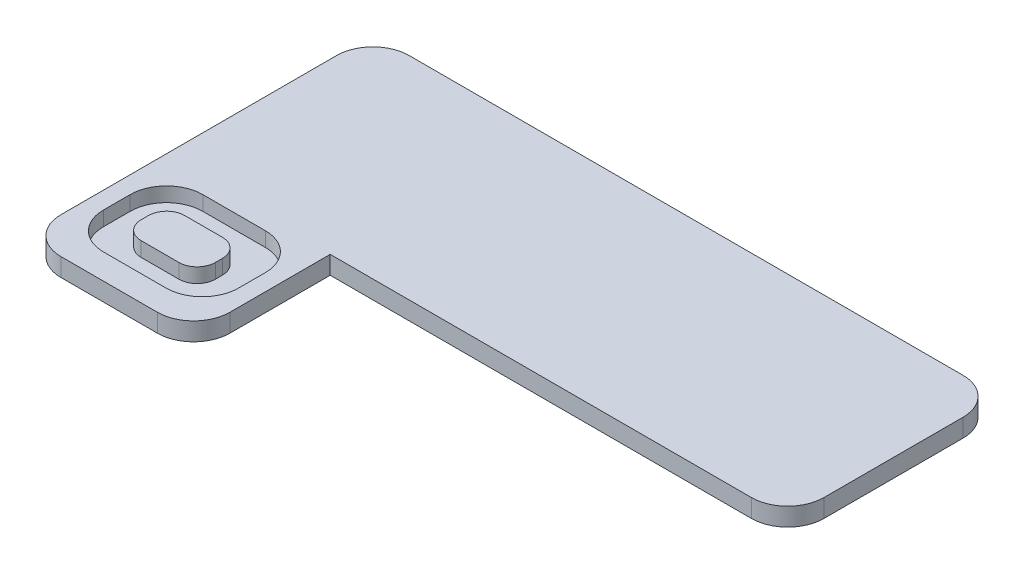
ISO-10303-21;
HEADER;
FILE_DESCRIPTION(('STEP AP214'),'2;1');
FILE_NAME('part.step','',(''),(''),'','','');
FILE_SCHEMA(('AUTOMOTIVE_DESIGN { 1 0 10303 214 1 1 1 1 }'));
ENDSEC;
DATA;
#1=APPLICATION_CONTEXT('core data for automotive mechanical design processes');
#2=APPLICATION_PROTOCOL_DEFINITION('international standard','automotive_design',2000,#1);
#3=PRODUCT_CONTEXT('',#1,'mechanical');
#4=PRODUCT('Part','Part','',(#3));
#5=PRODUCT_RELATED_PRODUCT_CATEGORY('part','',(#4));
#6=PRODUCT_DEFINITION_FORMATION('','',#4);
#7=PRODUCT_DEFINITION_CONTEXT('part definition',#1,'design');
#8=PRODUCT_DEFINITION('design','',#6,#7);
#9=PRODUCT_DEFINITION_SHAPE('','',#8);
#10=(LENGTH_UNIT() NAMED_UNIT(*) SI_UNIT(.MILLI.,.METRE.));
#11=(NAMED_UNIT(*) PLANE_ANGLE_UNIT() SI_UNIT($,.RADIAN.));
#12=(NAMED_UNIT(*) SI_UNIT($,.STERADIAN.) SOLID_ANGLE_UNIT());
#13=UNCERTAINTY_MEASURE_WITH_UNIT(LENGTH_MEASURE(1.E-05),#10,'distance_accuracy_value','');
#14=(GEOMETRIC_REPRESENTATION_CONTEXT(3) GLOBAL_UNCERTAINTY_ASSIGNED_CONTEXT((#13)) GLOBAL_UNIT_ASSIGNED_CONTEXT((#10,
#11,#12)) REPRESENTATION_CONTEXT('',''));
#15=CARTESIAN_POINT('',(0.,0.,0.));
#16=DIRECTION('',(0.,0.,1.));
#17=DIRECTION('',(1.,0.,0.));
#18=AXIS2_PLACEMENT_3D('',#15,#16,#17);
#19=CARTESIAN_POINT('',(2.54,1.27,21.8314835455681));
#20=DIRECTION('',(0.,-1.,0.));
#21=DIRECTION('',(0.,0.,-1.));
#22=AXIS2_PLACEMENT_3D('',#19,#20,#21);
#23=CYLINDRICAL_SURFACE('',#22,2.54);
#24=CARTESIAN_POINT('',(2.54,0.,21.8314835455681));
#25=DIRECTION('',(0.,1.,0.));
#26=DIRECTION('',(0.,0.,1.));
#27=AXIS2_PLACEMENT_3D('',#24,#25,#26);
#28=CIRCLE('',#27,2.54);
#29=CARTESIAN_POINT('',(0.,0.,21.831483545568));
#30=VERTEX_POINT('',#29);
#31=CARTESIAN_POINT('',(2.54000000000002,0.,24.3714835455681));
#32=VERTEX_POINT('',#31);
#33=EDGE_CURVE('E340',#30,#32,#28,.T.);
#34=ORIENTED_EDGE('',*,*,#33,.T.);
#35=DIRECTION('',(0.,-1.,0.));
#36=VECTOR('',#35,1.);
#37=CARTESIAN_POINT('',(2.54000000000002,1.27,24.3714835455681));
#38=LINE('',#37,#36);
#39=CARTESIAN_POINT('',(2.54000000000002,1.27,24.3714835455681));
#40=VERTEX_POINT('',#39);
#41=EDGE_CURVE('E11',#40,#32,#38,.T.);
#42=ORIENTED_EDGE('',*,*,#41,.F.);
#43=CARTESIAN_POINT('',(2.54,1.27,21.8314835455681));
#44=DIRECTION('',(0.,1.,0.));
#45=DIRECTION('',(0.,0.,1.));
#46=AXIS2_PLACEMENT_3D('',#43,#44,#45);
#47=CIRCLE('',#46,2.54);
#48=CARTESIAN_POINT('',(0.,1.27,21.831483545568));
#49=VERTEX_POINT('',#48);
#50=EDGE_CURVE('E354',#49,#40,#47,.T.);
#51=ORIENTED_EDGE('',*,*,#50,.F.);
#52=DIRECTION('',(0.,-1.,0.));
#53=VECTOR('',#52,1.);
#54=CARTESIAN_POINT('',(0.,1.27,21.831483545568));
#55=LINE('',#54,#53);
#56=EDGE_CURVE('E378',#49,#30,#55,.T.);
#57=ORIENTED_EDGE('',*,*,#56,.T.);
#58=EDGE_LOOP('',(#34,#42,#51,#57));
#59=FACE_BOUND('',#58,.T.);
#60=ADVANCED_FACE('F39',(#59),#23,.T.);
#61=CARTESIAN_POINT('',(2.54000000000002,1.27,24.3714835455681));
#62=DIRECTION('',(0.,0.,-1.));
#63=DIRECTION('',(-1.,0.,0.));
#64=AXIS2_PLACEMENT_3D('',#61,#62,#63);
#65=PLANE('',#64);
#66=DIRECTION('',(1.,0.,0.));
#67=VECTOR('',#66,1.);
#68=CARTESIAN_POINT('',(2.54000000000002,0.,24.3714835455681));
#69=LINE('',#68,#67);
#70=CARTESIAN_POINT('',(9.28733760299624,0.,24.3714835455681));
#71=VERTEX_POINT('',#70);
#72=EDGE_CURVE('E381',#32,#71,#69,.T.);
#73=ORIENTED_EDGE('',*,*,#72,.T.);
#74=DIRECTION('',(0.,-1.,0.));
#75=VECTOR('',#74,1.);
#76=CARTESIAN_POINT('',(9.28733760299624,1.27,24.3714835455681));
#77=LINE('',#76,#75);
#78=CARTESIAN_POINT('',(9.28733760299624,1.27,24.3714835455681));
#79=VERTEX_POINT('',#78);
#80=EDGE_CURVE('E46',#79,#71,#77,.T.);
#81=ORIENTED_EDGE('',*,*,#80,.F.);
#82=DIRECTION('',(1.,0.,0.));
#83=VECTOR('',#82,1.);
#84=CARTESIAN_POINT('',(2.54000000000002,1.27,24.3714835455681));
#85=LINE('',#84,#83);
#86=EDGE_CURVE('E357',#40,#79,#85,.T.);
#87=ORIENTED_EDGE('',*,*,#86,.F.);
#88=ORIENTED_EDGE('',*,*,#41,.T.);
#89=EDGE_LOOP('',(#73,#81,#87,#88));
#90=FACE_BOUND('',#89,.T.);
#91=ADVANCED_FACE('F454',(#90),#65,.F.);
#92=CARTESIAN_POINT('',(9.28733760299626,1.27,21.8314835455681));
#93=DIRECTION('',(0.,-1.,0.));
#94=DIRECTION('',(0.,0.,-1.));
#95=AXIS2_PLACEMENT_3D('',#92,#93,#94);
#96=CYLINDRICAL_SURFACE('',#95,2.54);
#97=CARTESIAN_POINT('',(9.28733760299626,0.,21.8314835455681));
#98=DIRECTION('',(0.,1.,0.));
#99=DIRECTION('',(0.,0.,1.));
#100=AXIS2_PLACEMENT_3D('',#97,#98,#99);
#101=CIRCLE('',#100,2.54);
#102=CARTESIAN_POINT('',(11.8273376029963,0.,21.831483545568));
#103=VERTEX_POINT('',#102);
#104=EDGE_CURVE('E383',#71,#103,#101,.T.);
#105=ORIENTED_EDGE('',*,*,#104,.T.);
#106=DIRECTION('',(0.,-1.,0.));
#107=VECTOR('',#106,1.);
#108=CARTESIAN_POINT('',(11.8273376029963,1.27,21.831483545568));
#109=LINE('',#108,#107);
#110=CARTESIAN_POINT('',(11.8273376029963,1.27,21.831483545568));
#111=VERTEX_POINT('',#110);
#112=EDGE_CURVE('E424',#111,#103,#109,.T.);
#113=ORIENTED_EDGE('',*,*,#112,.F.);
#114=CARTESIAN_POINT('',(9.28733760299626,1.27,21.8314835455681));
#115=DIRECTION('',(0.,1.,0.));
#116=DIRECTION('',(0.,0.,1.));
#117=AXIS2_PLACEMENT_3D('',#114,#115,#116);
#118=CIRCLE('',#117,2.54);
#119=EDGE_CURVE('E360',#79,#111,#118,.T.);
#120=ORIENTED_EDGE('',*,*,#119,.F.);
#121=ORIENTED_EDGE('',*,*,#80,.T.);
#122=EDGE_LOOP('',(#105,#113,#120,#121));
#123=FACE_BOUND('',#122,.T.);
#124=ADVANCED_FACE('F431',(#123),#96,.T.);
#125=CARTESIAN_POINT('',(11.8273376029963,1.27,21.831483545568));
#126=DIRECTION('',(-1.,0.,0.));
#127=DIRECTION('',(0.,0.,1.));
#128=AXIS2_PLACEMENT_3D('',#125,#126,#127);
#129=PLANE('',#128);
#130=DIRECTION('',(0.,0.,-1.));
#131=VECTOR('',#130,1.);
#132=CARTESIAN_POINT('',(11.8273376029963,0.,21.831483545568));
#133=LINE('',#132,#131);
#134=CARTESIAN_POINT('',(11.8273376029963,0.,14.8140390178943));
#135=VERTEX_POINT('',#134);
#136=EDGE_CURVE('E385',#103,#135,#133,.T.);
#137=ORIENTED_EDGE('',*,*,#136,.T.);
#138=DIRECTION('',(0.,-1.,0.));
#139=VECTOR('',#138,1.);
#140=CARTESIAN_POINT('',(11.8273376029963,1.27,14.8140390178943));
#141=LINE('',#140,#139);
#142=CARTESIAN_POINT('',(11.8273376029963,1.27,14.8140390178943));
#143=VERTEX_POINT('',#142);
#144=EDGE_CURVE('E421',#143,#135,#141,.T.);
#145=ORIENTED_EDGE('',*,*,#144,.F.);
#146=DIRECTION('',(0.,0.,-1.));
#147=VECTOR('',#146,1.);
#148=CARTESIAN_POINT('',(11.8273376029963,1.27,21.831483545568));
#149=LINE('',#148,#147);
#150=EDGE_CURVE('E362',#111,#143,#149,.T.);
#151=ORIENTED_EDGE('',*,*,#150,.F.);
#152=ORIENTED_EDGE('',*,*,#112,.T.);
#153=EDGE_LOOP('',(#137,#145,#151,#152));
#154=FACE_BOUND('',#153,.T.);
#155=ADVANCED_FACE('F442',(#154),#129,.F.);
#156=CARTESIAN_POINT('',(41.3047767707033,1.27,14.8140390178943));
#157=DIRECTION('',(0.,0.,-1.));
#158=DIRECTION('',(-1.,0.,0.));
#159=AXIS2_PLACEMENT_3D('',#156,#157,#158);
#160=PLANE('',#159);
#161=DIRECTION('',(1.,0.,0.));
#162=VECTOR('',#161,1.);
#163=CARTESIAN_POINT('',(41.3047767707033,0.,14.8140390178943));
#164=LINE('',#163,#162);
#165=CARTESIAN_POINT('',(41.3047767707033,0.,14.8140390178943));
#166=VERTEX_POINT('',#165);
#167=EDGE_CURVE('E387',#135,#166,#164,.T.);
#168=ORIENTED_EDGE('',*,*,#167,.T.);
#169=DIRECTION('',(0.,-1.,0.));
#170=VECTOR('',#169,1.);
#171=CARTESIAN_POINT('',(41.3047767707033,1.27,14.8140390178943));
#172=LINE('',#171,#170);
#173=CARTESIAN_POINT('',(41.3047767707033,1.27,14.8140390178943));
#174=VERTEX_POINT('',#173);
#175=EDGE_CURVE('E418',#174,#166,#172,.T.);
#176=ORIENTED_EDGE('',*,*,#175,.F.);
#177=DIRECTION('',(1.,0.,0.));
#178=VECTOR('',#177,1.);
#179=CARTESIAN_POINT('',(41.3047767707033,1.27,14.8140390178943));
#180=LINE('',#179,#178);
#181=EDGE_CURVE('E364',#143,#174,#180,.T.);
#182=ORIENTED_EDGE('',*,*,#181,.F.);
#183=ORIENTED_EDGE('',*,*,#144,.T.);
#184=EDGE_LOOP('',(#168,#176,#182,#183));
#185=FACE_BOUND('',#184,.T.);
#186=ADVANCED_FACE('F446',(#185),#160,.F.);
#187=CARTESIAN_POINT('',(41.3047767707033,1.27,12.2740390178943));
#188=DIRECTION('',(0.,-1.,0.));
#189=DIRECTION('',(0.,0.,-1.));
#190=AXIS2_PLACEMENT_3D('',#187,#188,#189);
#191=CYLINDRICAL_SURFACE('',#190,2.54);
#192=CARTESIAN_POINT('',(41.3047767707033,0.,12.2740390178943));
#193=DIRECTION('',(0.,1.,0.));
#194=DIRECTION('',(0.,0.,-1.));
#195=AXIS2_PLACEMENT_3D('',#192,#193,#194);
#196=CIRCLE('',#195,2.54);
#197=CARTESIAN_POINT('',(43.8447767707033,0.,12.2740390178943));
#198=VERTEX_POINT('',#197);
#199=EDGE_CURVE('E389',#166,#198,#196,.T.);
#200=ORIENTED_EDGE('',*,*,#199,.T.);
#201=DIRECTION('',(0.,-1.,0.));
#202=VECTOR('',#201,1.);
#203=CARTESIAN_POINT('',(43.8447767707033,1.27,12.2740390178943));
#204=LINE('',#203,#202);
#205=CARTESIAN_POINT('',(43.8447767707033,1.27,12.2740390178943));
#206=VERTEX_POINT('',#205);
#207=EDGE_CURVE('E415',#206,#198,#204,.T.);
#208=ORIENTED_EDGE('',*,*,#207,.F.);
#209=CARTESIAN_POINT('',(41.3047767707033,1.27,12.2740390178943));
#210=DIRECTION('',(0.,1.,0.));
#211=DIRECTION('',(0.,0.,-1.));
#212=AXIS2_PLACEMENT_3D('',#209,#210,#211);
#213=CIRCLE('',#212,2.54);
#214=EDGE_CURVE('E366',#174,#206,#213,.T.);
#215=ORIENTED_EDGE('',*,*,#214,.F.);
#216=ORIENTED_EDGE('',*,*,#175,.T.);
#217=EDGE_LOOP('',(#200,#208,#215,#216));
#218=FACE_BOUND('',#217,.T.);
#219=ADVANCED_FACE('F481',(#218),#191,.T.);
#220=CARTESIAN_POINT('',(43.8447767707033,1.27,2.54000000000002));
#221=DIRECTION('',(-1.,0.,0.));
#222=DIRECTION('',(0.,0.,1.));
#223=AXIS2_PLACEMENT_3D('',#220,#221,#222);
#224=PLANE('',#223);
#225=DIRECTION('',(0.,0.,-1.));
#226=VECTOR('',#225,1.);
#227=CARTESIAN_POINT('',(43.8447767707033,0.,2.54000000000002));
#228=LINE('',#227,#226);
#229=CARTESIAN_POINT('',(43.8447767707033,0.,2.54000000000002));
#230=VERTEX_POINT('',#229);
#231=EDGE_CURVE('E391',#198,#230,#228,.T.);
#232=ORIENTED_EDGE('',*,*,#231,.T.);
#233=DIRECTION('',(0.,-1.,0.));
#234=VECTOR('',#233,1.);
#235=CARTESIAN_POINT('',(43.8447767707033,1.27,2.54000000000002));
#236=LINE('',#235,#234);
#237=CARTESIAN_POINT('',(43.8447767707033,1.27,2.54000000000002));
#238=VERTEX_POINT('',#237);
#239=EDGE_CURVE('E412',#238,#230,#236,.T.);
#240=ORIENTED_EDGE('',*,*,#239,.F.);
#241=DIRECTION('',(0.,0.,-1.));
#242=VECTOR('',#241,1.);
#243=CARTESIAN_POINT('',(43.8447767707033,1.27,2.54000000000002));
#244=LINE('',#243,#242);
#245=EDGE_CURVE('E368',#206,#238,#244,.T.);
#246=ORIENTED_EDGE('',*,*,#245,.F.);
#247=ORIENTED_EDGE('',*,*,#207,.T.);
#248=EDGE_LOOP('',(#232,#240,#246,#247));
#249=FACE_BOUND('',#248,.T.);
#250=ADVANCED_FACE('F479',(#249),#224,.F.);
#251=CARTESIAN_POINT('',(41.3047767707033,1.27,2.54));
#252=DIRECTION('',(0.,-1.,0.));
#253=DIRECTION('',(0.,0.,-1.));
#254=AXIS2_PLACEMENT_3D('',#251,#252,#253);
#255=CYLINDRICAL_SURFACE('',#254,2.54);
#256=CARTESIAN_POINT('',(41.3047767707033,0.,2.54));
#257=DIRECTION('',(0.,1.,0.));
#258=DIRECTION('',(0.,0.,-1.));
#259=AXIS2_PLACEMENT_3D('',#256,#257,#258);
#260=CIRCLE('',#259,2.54);
#261=CARTESIAN_POINT('',(41.3047767707033,0.,0.));
#262=VERTEX_POINT('',#261);
#263=EDGE_CURVE('E393',#230,#262,#260,.T.);
#264=ORIENTED_EDGE('',*,*,#263,.T.);
#265=DIRECTION('',(0.,-1.,0.));
#266=VECTOR('',#265,1.);
#267=CARTESIAN_POINT('',(41.3047767707033,1.27,0.));
#268=LINE('',#267,#266);
#269=CARTESIAN_POINT('',(41.3047767707033,1.27,0.));
#270=VERTEX_POINT('',#269);
#271=EDGE_CURVE('E409',#270,#262,#268,.T.);
#272=ORIENTED_EDGE('',*,*,#271,.F.);
#273=CARTESIAN_POINT('',(41.3047767707033,1.27,2.54));
#274=DIRECTION('',(0.,1.,0.));
#275=DIRECTION('',(0.,0.,-1.));
#276=AXIS2_PLACEMENT_3D('',#273,#274,#275);
#277=CIRCLE('',#276,2.54);
#278=EDGE_CURVE('E370',#238,#270,#277,.T.);
#279=ORIENTED_EDGE('',*,*,#278,.F.);
#280=ORIENTED_EDGE('',*,*,#239,.T.);
#281=EDGE_LOOP('',(#264,#272,#279,#280));
#282=FACE_BOUND('',#281,.T.);
#283=ADVANCED_FACE('F475',(#282),#255,.T.);
#284=CARTESIAN_POINT('',(2.54000000000002,1.27,0.));
#285=DIRECTION('',(0.,0.,1.));
#286=DIRECTION('',(1.,0.,0.));
#287=AXIS2_PLACEMENT_3D('',#284,#285,#286);
#288=PLANE('',#287);
#289=DIRECTION('',(-1.,0.,0.));
#290=VECTOR('',#289,1.);
#291=CARTESIAN_POINT('',(2.54000000000002,0.,0.));
#292=LINE('',#291,#290);
#293=CARTESIAN_POINT('',(2.54000000000002,0.,0.));
#294=VERTEX_POINT('',#293);
#295=EDGE_CURVE('E395',#262,#294,#292,.T.);
#296=ORIENTED_EDGE('',*,*,#295,.T.);
#297=DIRECTION('',(0.,-1.,0.));
#298=VECTOR('',#297,1.);
#299=CARTESIAN_POINT('',(2.54000000000002,1.27,0.));
#300=LINE('',#299,#298);
#301=CARTESIAN_POINT('',(2.54000000000002,1.27,0.));
#302=VERTEX_POINT('',#301);
#303=EDGE_CURVE('E406',#302,#294,#300,.T.);
#304=ORIENTED_EDGE('',*,*,#303,.F.);
#305=DIRECTION('',(-1.,0.,0.));
#306=VECTOR('',#305,1.);
#307=CARTESIAN_POINT('',(2.54000000000002,1.27,0.));
#308=LINE('',#307,#306);
#309=EDGE_CURVE('E372',#270,#302,#308,.T.);
#310=ORIENTED_EDGE('',*,*,#309,.F.);
#311=ORIENTED_EDGE('',*,*,#271,.T.);
#312=EDGE_LOOP('',(#296,#304,#310,#311));
#313=FACE_BOUND('',#312,.T.);
#314=ADVANCED_FACE('F471',(#313),#288,.F.);
#315=CARTESIAN_POINT('',(2.54,1.27,2.54));
#316=DIRECTION('',(0.,-1.,0.));
#317=DIRECTION('',(0.,0.,-1.));
#318=AXIS2_PLACEMENT_3D('',#315,#316,#317);
#319=CYLINDRICAL_SURFACE('',#318,2.54);
#320=CARTESIAN_POINT('',(2.54,0.,2.54));
#321=DIRECTION('',(0.,1.,0.));
#322=DIRECTION('',(0.,0.,1.));
#323=AXIS2_PLACEMENT_3D('',#320,#321,#322);
#324=CIRCLE('',#323,2.54);
#325=CARTESIAN_POINT('',(0.,0.,2.54000000000002));
#326=VERTEX_POINT('',#325);
#327=EDGE_CURVE('E397',#294,#326,#324,.T.);
#328=ORIENTED_EDGE('',*,*,#327,.T.);
#329=DIRECTION('',(0.,-1.,0.));
#330=VECTOR('',#329,1.);
#331=CARTESIAN_POINT('',(0.,1.27,2.54000000000002));
#332=LINE('',#331,#330);
#333=CARTESIAN_POINT('',(0.,1.27,2.54000000000002));
#334=VERTEX_POINT('',#333);
#335=EDGE_CURVE('E403',#334,#326,#332,.T.);
#336=ORIENTED_EDGE('',*,*,#335,.F.);
#337=CARTESIAN_POINT('',(2.54,1.27,2.54));
#338=DIRECTION('',(0.,1.,0.));
#339=DIRECTION('',(0.,0.,1.));
#340=AXIS2_PLACEMENT_3D('',#337,#338,#339);
#341=CIRCLE('',#340,2.54);
#342=EDGE_CURVE('E374',#302,#334,#341,.T.);
#343=ORIENTED_EDGE('',*,*,#342,.F.);
#344=ORIENTED_EDGE('',*,*,#303,.T.);
#345=EDGE_LOOP('',(#328,#336,#343,#344));
#346=FACE_BOUND('',#345,.T.);
#347=ADVANCED_FACE('F462',(#346),#319,.T.);
#348=CARTESIAN_POINT('',(0.,1.27,14.8140390178943));
#349=DIRECTION('',(1.,0.,0.));
#350=DIRECTION('',(0.,0.,-1.));
#351=AXIS2_PLACEMENT_3D('',#348,#349,#350);
#352=PLANE('',#351);
#353=DIRECTION('',(0.,0.,1.));
#354=VECTOR('',#353,1.);
#355=CARTESIAN_POINT('',(0.,0.,14.8140390178943));
#356=LINE('',#355,#354);
#357=EDGE_CURVE('E358',#326,#30,#356,.T.);
#358=ORIENTED_EDGE('',*,*,#357,.T.);
#359=ORIENTED_EDGE('',*,*,#56,.F.);
#360=DIRECTION('',(0.,0.,1.));
#361=VECTOR('',#360,1.);
#362=CARTESIAN_POINT('',(0.,1.27,14.8140390178943));
#363=LINE('',#362,#361);
#364=EDGE_CURVE('E376',#334,#49,#363,.T.);
#365=ORIENTED_EDGE('',*,*,#364,.F.);
#366=ORIENTED_EDGE('',*,*,#335,.T.);
#367=EDGE_LOOP('',(#358,#359,#365,#366));
#368=FACE_BOUND('',#367,.T.);
#369=ADVANCED_FACE('F466',(#368),#352,.F.);
#370=CARTESIAN_POINT('',(2.54,1.27,21.8314835455681));
#371=DIRECTION('',(0.,1.,0.));
#372=DIRECTION('',(0.,0.,1.));
#373=AXIS2_PLACEMENT_3D('',#370,#371,#372);
#374=PLANE('',#373);
#375=CARTESIAN_POINT('',(3.74461504693691,1.27,20.0614829242593));
#376=DIRECTION('',(0.,1.,0.));
#377=DIRECTION('',(0.,0.,1.));
#378=AXIS2_PLACEMENT_3D('',#375,#376,#377);
#379=CIRCLE('',#378,2.54);
#380=CARTESIAN_POINT('',(1.20461504693691,1.27,20.0614829242593));
#381=VERTEX_POINT('',#380);
#382=CARTESIAN_POINT('',(3.74461504693691,1.27,22.6014829242593));
#383=VERTEX_POINT('',#382);
#384=EDGE_CURVE('E53',#381,#383,#379,.T.);
#385=ORIENTED_EDGE('',*,*,#384,.F.);
#386=DIRECTION('',(0.,0.,1.));
#387=VECTOR('',#386,1.);
#388=CARTESIAN_POINT('',(1.20461504693691,1.27,18.1895751002719));
#389=LINE('',#388,#387);
#390=CARTESIAN_POINT('',(1.20461504693691,1.27,18.1895751002719));
#391=VERTEX_POINT('',#390);
#392=EDGE_CURVE('E295',#391,#381,#389,.T.);
#393=ORIENTED_EDGE('',*,*,#392,.F.);
#394=CARTESIAN_POINT('',(3.74461504693691,1.27,18.1895751002719));
#395=DIRECTION('',(0.,1.,0.));
#396=DIRECTION('',(0.,0.,1.));
#397=AXIS2_PLACEMENT_3D('',#394,#395,#396);
#398=CIRCLE('',#397,2.54);
#399=CARTESIAN_POINT('',(3.74461504693691,1.27,15.6495751002719));
#400=VERTEX_POINT('',#399);
#401=EDGE_CURVE('E333',#400,#391,#398,.T.);
#402=ORIENTED_EDGE('',*,*,#401,.F.);
#403=DIRECTION('',(-1.,0.,0.));
#404=VECTOR('',#403,1.);
#405=CARTESIAN_POINT('',(8.12520089631181,1.27,15.6495751002719));
#406=LINE('',#405,#404);
#407=CARTESIAN_POINT('',(8.12520089631181,1.27,15.6495751002719));
#408=VERTEX_POINT('',#407);
#409=EDGE_CURVE('E330',#408,#400,#406,.T.);
#410=ORIENTED_EDGE('',*,*,#409,.F.);
#411=CARTESIAN_POINT('',(8.12520089631181,1.27,18.1895751002719));
#412=DIRECTION('',(0.,1.,0.));
#413=DIRECTION('',(0.,0.,-1.));
#414=AXIS2_PLACEMENT_3D('',#411,#412,#413);
#415=CIRCLE('',#414,2.54);
#416=CARTESIAN_POINT('',(10.6652008963118,1.27,18.1895751002719));
#417=VERTEX_POINT('',#416);
#418=EDGE_CURVE('E327',#417,#408,#415,.T.);
#419=ORIENTED_EDGE('',*,*,#418,.F.);
#420=DIRECTION('',(0.,0.,-1.));
#421=VECTOR('',#420,1.);
#422=CARTESIAN_POINT('',(10.6652008963118,1.27,20.0614829242593));
#423=LINE('',#422,#421);
#424=CARTESIAN_POINT('',(10.6652008963118,1.27,20.0614829242593));
#425=VERTEX_POINT('',#424);
#426=EDGE_CURVE('E324',#425,#417,#423,.T.);
#427=ORIENTED_EDGE('',*,*,#426,.F.);
#428=CARTESIAN_POINT('',(8.12520089631181,1.27,20.0614829242593));
#429=DIRECTION('',(0.,1.,0.));
#430=DIRECTION('',(0.,0.,1.));
#431=AXIS2_PLACEMENT_3D('',#428,#429,#430);
#432=CIRCLE('',#431,2.54);
#433=CARTESIAN_POINT('',(8.12520089631181,1.27,22.6014829242593));
#434=VERTEX_POINT('',#433);
#435=EDGE_CURVE('E321',#434,#425,#432,.T.);
#436=ORIENTED_EDGE('',*,*,#435,.F.);
#437=DIRECTION('',(1.,0.,0.));
#438=VECTOR('',#437,1.);
#439=CARTESIAN_POINT('',(3.74461504693691,1.27,22.6014829242593));
#440=LINE('',#439,#438);
#441=EDGE_CURVE('E318',#383,#434,#440,.T.);
#442=ORIENTED_EDGE('',*,*,#441,.F.);
#443=EDGE_LOOP('',(#385,#393,#402,#410,#419,#427,#436,#442));
#444=FACE_BOUND('',#443,.T.);
#445=ORIENTED_EDGE('',*,*,#50,.T.);
#446=ORIENTED_EDGE('',*,*,#86,.T.);
#447=ORIENTED_EDGE('',*,*,#119,.T.);
#448=ORIENTED_EDGE('',*,*,#150,.T.);
#449=ORIENTED_EDGE('',*,*,#181,.T.);
#450=ORIENTED_EDGE('',*,*,#214,.T.);
#451=ORIENTED_EDGE('',*,*,#245,.T.);
#452=ORIENTED_EDGE('',*,*,#278,.T.);
#453=ORIENTED_EDGE('',*,*,#309,.T.);
#454=ORIENTED_EDGE('',*,*,#342,.T.);
#455=ORIENTED_EDGE('',*,*,#364,.T.);
#456=EDGE_LOOP('',(#445,#446,#447,#448,#449,#450,#451,#452,#453,#454,#455));
#457=FACE_BOUND('',#456,.T.);
#458=ADVANCED_FACE('F450',(#444,#457),#374,.T.);
#459=CARTESIAN_POINT('',(2.54,0.,21.8314835455681));
#460=DIRECTION('',(0.,1.,0.));
#461=DIRECTION('',(0.,0.,1.));
#462=AXIS2_PLACEMENT_3D('',#459,#460,#461);
#463=PLANE('',#462);
#464=ORIENTED_EDGE('',*,*,#33,.F.);
#465=ORIENTED_EDGE('',*,*,#357,.F.);
#466=ORIENTED_EDGE('',*,*,#327,.F.);
#467=ORIENTED_EDGE('',*,*,#295,.F.);
#468=ORIENTED_EDGE('',*,*,#263,.F.);
#469=ORIENTED_EDGE('',*,*,#231,.F.);
#470=ORIENTED_EDGE('',*,*,#199,.F.);
#471=ORIENTED_EDGE('',*,*,#167,.F.);
#472=ORIENTED_EDGE('',*,*,#136,.F.);
#473=ORIENTED_EDGE('',*,*,#104,.F.);
#474=ORIENTED_EDGE('',*,*,#72,.F.);
#475=EDGE_LOOP('',(#464,#465,#466,#467,#468,#469,#470,#471,#472,#473,#474));
#476=FACE_BOUND('',#475,.T.);
#477=ADVANCED_FACE('F437',(#476),#463,.F.);
#478=CARTESIAN_POINT('',(3.74461504693691,0.254000000000001,20.0614829242593));
#479=DIRECTION('',(0.,1.,0.));
#480=DIRECTION('',(0.,0.,1.));
#481=AXIS2_PLACEMENT_3D('',#478,#479,#480);
#482=CYLINDRICAL_SURFACE('',#481,2.54);
#483=ORIENTED_EDGE('',*,*,#384,.T.);
#484=DIRECTION('',(0.,1.,0.));
#485=VECTOR('',#484,1.);
#486=CARTESIAN_POINT('',(3.74461504693691,0.254000000000001,22.6014829242593));
#487=LINE('',#486,#485);
#488=CARTESIAN_POINT('',(3.74461504693691,0.254000000000001,22.6014829242593));
#489=VERTEX_POINT('',#488);
#490=EDGE_CURVE('E316',#489,#383,#487,.T.);
#491=ORIENTED_EDGE('',*,*,#490,.F.);
#492=CARTESIAN_POINT('',(3.74461504693691,0.254000000000001,20.0614829242593));
#493=DIRECTION('',(0.,1.,0.));
#494=DIRECTION('',(0.,0.,1.));
#495=AXIS2_PLACEMENT_3D('',#492,#493,#494);
#496=CIRCLE('',#495,2.54);
#497=CARTESIAN_POINT('',(1.20461504693691,0.254000000000001,20.0614829242593));
#498=VERTEX_POINT('',#497);
#499=EDGE_CURVE('E291',#498,#489,#496,.T.);
#500=ORIENTED_EDGE('',*,*,#499,.F.);
#501=DIRECTION('',(0.,1.,0.));
#502=VECTOR('',#501,1.);
#503=CARTESIAN_POINT('',(1.20461504693691,0.254000000000001,20.0614829242593));
#504=LINE('',#503,#502);
#505=EDGE_CURVE('E338',#498,#381,#504,.T.);
#506=ORIENTED_EDGE('',*,*,#505,.T.);
#507=EDGE_LOOP('',(#483,#491,#500,#506));
#508=FACE_BOUND('',#507,.T.);
#509=ADVANCED_FACE('F562',(#508),#482,.F.);
#510=CARTESIAN_POINT('',(1.20461504693691,0.254000000000001,18.1895751002719));
#511=DIRECTION('',(-1.,0.,0.));
#512=DIRECTION('',(0.,0.,1.));
#513=AXIS2_PLACEMENT_3D('',#510,#511,#512);
#514=PLANE('',#513);
#515=ORIENTED_EDGE('',*,*,#392,.T.);
#516=ORIENTED_EDGE('',*,*,#505,.F.);
#517=DIRECTION('',(0.,0.,1.));
#518=VECTOR('',#517,1.);
#519=CARTESIAN_POINT('',(1.20461504693691,0.254000000000001,18.1895751002719));
#520=LINE('',#519,#518);
#521=CARTESIAN_POINT('',(1.20461504693691,0.254000000000001,18.1895751002719));
#522=VERTEX_POINT('',#521);
#523=EDGE_CURVE('E313',#522,#498,#520,.T.);
#524=ORIENTED_EDGE('',*,*,#523,.F.);
#525=DIRECTION('',(0.,1.,0.));
#526=VECTOR('',#525,1.);
#527=CARTESIAN_POINT('',(1.20461504693691,0.254000000000001,18.1895751002719));
#528=LINE('',#527,#526);
#529=EDGE_CURVE('E341',#522,#391,#528,.T.);
#530=ORIENTED_EDGE('',*,*,#529,.T.);
#531=EDGE_LOOP('',(#515,#516,#524,#530));
#532=FACE_BOUND('',#531,.T.);
#533=ADVANCED_FACE('F580',(#532),#514,.F.);
#534=CARTESIAN_POINT('',(3.74461504693691,0.254000000000001,18.1895751002719));
#535=DIRECTION('',(0.,1.,0.));
#536=DIRECTION('',(0.,0.,1.));
#537=AXIS2_PLACEMENT_3D('',#534,#535,#536);
#538=CYLINDRICAL_SURFACE('',#537,2.54);
#539=ORIENTED_EDGE('',*,*,#401,.T.);
#540=ORIENTED_EDGE('',*,*,#529,.F.);
#541=CARTESIAN_POINT('',(3.74461504693691,0.254000000000001,18.1895751002719));
#542=DIRECTION('',(0.,1.,0.));
#543=DIRECTION('',(0.,0.,1.));
#544=AXIS2_PLACEMENT_3D('',#541,#542,#543);
#545=CIRCLE('',#544,2.54);
#546=CARTESIAN_POINT('',(3.74461504693691,0.254000000000001,15.6495751002719));
#547=VERTEX_POINT('',#546);
#548=EDGE_CURVE('E310',#547,#522,#545,.T.);
#549=ORIENTED_EDGE('',*,*,#548,.F.);
#550=DIRECTION('',(0.,1.,0.));
#551=VECTOR('',#550,1.);
#552=CARTESIAN_POINT('',(3.74461504693691,0.254000000000001,15.6495751002719));
#553=LINE('',#552,#551);
#554=EDGE_CURVE('E343',#547,#400,#553,.T.);
#555=ORIENTED_EDGE('',*,*,#554,.T.);
#556=EDGE_LOOP('',(#539,#540,#549,#555));
#557=FACE_BOUND('',#556,.T.);
#558=ADVANCED_FACE('F589',(#557),#538,.F.);
#559=CARTESIAN_POINT('',(8.12520089631181,0.254000000000001,15.6495751002719));
#560=DIRECTION('',(0.,0.,-1.));
#561=DIRECTION('',(-1.,0.,0.));
#562=AXIS2_PLACEMENT_3D('',#559,#560,#561);
#563=PLANE('',#562);
#564=ORIENTED_EDGE('',*,*,#409,.T.);
#565=ORIENTED_EDGE('',*,*,#554,.F.);
#566=DIRECTION('',(-1.,0.,0.));
#567=VECTOR('',#566,1.);
#568=CARTESIAN_POINT('',(8.12520089631181,0.254000000000001,15.6495751002719));
#569=LINE('',#568,#567);
#570=CARTESIAN_POINT('',(8.12520089631181,0.254000000000001,15.6495751002719));
#571=VERTEX_POINT('',#570);
#572=EDGE_CURVE('E307',#571,#547,#569,.T.);
#573=ORIENTED_EDGE('',*,*,#572,.F.);
#574=DIRECTION('',(0.,1.,0.));
#575=VECTOR('',#574,1.);
#576=CARTESIAN_POINT('',(8.12520089631181,0.254000000000001,15.6495751002719));
#577=LINE('',#576,#575);
#578=EDGE_CURVE('E345',#571,#408,#577,.T.);
#579=ORIENTED_EDGE('',*,*,#578,.T.);
#580=EDGE_LOOP('',(#564,#565,#573,#579));
#581=FACE_BOUND('',#580,.T.);
#582=ADVANCED_FACE('F599',(#581),#563,.F.);
#583=CARTESIAN_POINT('',(8.12520089631181,0.254000000000001,18.1895751002719));
#584=DIRECTION('',(0.,1.,0.));
#585=DIRECTION('',(0.,0.,1.));
#586=AXIS2_PLACEMENT_3D('',#583,#584,#585);
#587=CYLINDRICAL_SURFACE('',#586,2.54);
#588=ORIENTED_EDGE('',*,*,#418,.T.);
#589=ORIENTED_EDGE('',*,*,#578,.F.);
#590=CARTESIAN_POINT('',(8.12520089631181,0.254000000000001,18.1895751002719));
#591=DIRECTION('',(0.,1.,0.));
#592=DIRECTION('',(0.,0.,-1.));
#593=AXIS2_PLACEMENT_3D('',#590,#591,#592);
#594=CIRCLE('',#593,2.54);
#595=CARTESIAN_POINT('',(10.6652008963118,0.254000000000001,18.1895751002719));
#596=VERTEX_POINT('',#595);
#597=EDGE_CURVE('E304',#596,#571,#594,.T.);
#598=ORIENTED_EDGE('',*,*,#597,.F.);
#599=DIRECTION('',(0.,1.,0.));
#600=VECTOR('',#599,1.);
#601=CARTESIAN_POINT('',(10.6652008963118,0.254000000000001,18.1895751002719));
#602=LINE('',#601,#600);
#603=EDGE_CURVE('E347',#596,#417,#602,.T.);
#604=ORIENTED_EDGE('',*,*,#603,.T.);
#605=EDGE_LOOP('',(#588,#589,#598,#604));
#606=FACE_BOUND('',#605,.T.);
#607=ADVANCED_FACE('F609',(#606),#587,.F.);
#608=CARTESIAN_POINT('',(10.6652008963118,0.254000000000001,20.0614829242593));
#609=DIRECTION('',(1.,0.,0.));
#610=DIRECTION('',(0.,0.,-1.));
#611=AXIS2_PLACEMENT_3D('',#608,#609,#610);
#612=PLANE('',#611);
#613=ORIENTED_EDGE('',*,*,#426,.T.);
#614=ORIENTED_EDGE('',*,*,#603,.F.);
#615=DIRECTION('',(0.,0.,-1.));
#616=VECTOR('',#615,1.);
#617=CARTESIAN_POINT('',(10.6652008963118,0.254000000000001,20.0614829242593));
#618=LINE('',#617,#616);
#619=CARTESIAN_POINT('',(10.6652008963118,0.254000000000001,20.0614829242593));
#620=VERTEX_POINT('',#619);
#621=EDGE_CURVE('E301',#620,#596,#618,.T.);
#622=ORIENTED_EDGE('',*,*,#621,.F.);
#623=DIRECTION('',(0.,1.,0.));
#624=VECTOR('',#623,1.);
#625=CARTESIAN_POINT('',(10.6652008963118,0.254000000000001,20.0614829242593));
#626=LINE('',#625,#624);
#627=EDGE_CURVE('E349',#620,#425,#626,.T.);
#628=ORIENTED_EDGE('',*,*,#627,.T.);
#629=EDGE_LOOP('',(#613,#614,#622,#628));
#630=FACE_BOUND('',#629,.T.);
#631=ADVANCED_FACE('F619',(#630),#612,.F.);
#632=CARTESIAN_POINT('',(8.12520089631181,0.254000000000001,20.0614829242593));
#633=DIRECTION('',(0.,1.,0.));
#634=DIRECTION('',(0.,0.,1.));
#635=AXIS2_PLACEMENT_3D('',#632,#633,#634);
#636=CYLINDRICAL_SURFACE('',#635,2.54);
#637=ORIENTED_EDGE('',*,*,#435,.T.);
#638=ORIENTED_EDGE('',*,*,#627,.F.);
#639=CARTESIAN_POINT('',(8.12520089631181,0.254000000000001,20.0614829242593));
#640=DIRECTION('',(0.,1.,0.));
#641=DIRECTION('',(0.,0.,1.));
#642=AXIS2_PLACEMENT_3D('',#639,#640,#641);
#643=CIRCLE('',#642,2.54);
#644=CARTESIAN_POINT('',(8.12520089631181,0.254000000000001,22.6014829242593));
#645=VERTEX_POINT('',#644);
#646=EDGE_CURVE('E298',#645,#620,#643,.T.);
#647=ORIENTED_EDGE('',*,*,#646,.F.);
#648=DIRECTION('',(0.,1.,0.));
#649=VECTOR('',#648,1.);
#650=CARTESIAN_POINT('',(8.12520089631181,0.254000000000001,22.6014829242593));
#651=LINE('',#650,#649);
#652=EDGE_CURVE('E351',#645,#434,#651,.T.);
#653=ORIENTED_EDGE('',*,*,#652,.T.);
#654=EDGE_LOOP('',(#637,#638,#647,#653));
#655=FACE_BOUND('',#654,.T.);
#656=ADVANCED_FACE('F629',(#655),#636,.F.);
#657=CARTESIAN_POINT('',(3.74461504693691,0.254000000000001,22.6014829242593));
#658=DIRECTION('',(0.,0.,1.));
#659=DIRECTION('',(1.,0.,0.));
#660=AXIS2_PLACEMENT_3D('',#657,#658,#659);
#661=PLANE('',#660);
#662=ORIENTED_EDGE('',*,*,#441,.T.);
#663=ORIENTED_EDGE('',*,*,#652,.F.);
#664=DIRECTION('',(1.,0.,0.));
#665=VECTOR('',#664,1.);
#666=CARTESIAN_POINT('',(3.74461504693691,0.254000000000001,22.6014829242593));
#667=LINE('',#666,#665);
#668=EDGE_CURVE('E294',#489,#645,#667,.T.);
#669=ORIENTED_EDGE('',*,*,#668,.F.);
#670=ORIENTED_EDGE('',*,*,#490,.T.);
#671=EDGE_LOOP('',(#662,#663,#669,#670));
#672=FACE_BOUND('',#671,.T.);
#673=ADVANCED_FACE('F639',(#672),#661,.F.);
#674=CARTESIAN_POINT('',(3.74461504693691,0.254000000000001,20.0614829242593));
#675=DIRECTION('',(0.,1.,0.));
#676=DIRECTION('',(0.,0.,1.));
#677=AXIS2_PLACEMENT_3D('',#674,#675,#676);
#678=PLANE('',#677);
#679=DIRECTION('',(0.,0.,1.));
#680=VECTOR('',#679,1.);
#681=CARTESIAN_POINT('',(3.11492565113761,0.254000000000001,18.8228048988717));
#682=LINE('',#681,#680);
#683=CARTESIAN_POINT('',(3.11492565113761,0.254000000000001,18.8228048988717));
#684=VERTEX_POINT('',#683);
#685=CARTESIAN_POINT('',(3.11492565113761,0.254000000000001,19.33020514843));
#686=VERTEX_POINT('',#685);
#687=EDGE_CURVE('E229',#684,#686,#682,.T.);
#688=ORIENTED_EDGE('',*,*,#687,.F.);
#689=CARTESIAN_POINT('',(4.38492565113761,0.254000000000001,18.8228048988717));
#690=DIRECTION('',(0.,1.,0.));
#691=DIRECTION('',(0.,0.,1.));
#692=AXIS2_PLACEMENT_3D('',#689,#690,#691);
#693=CIRCLE('',#692,1.27);
#694=CARTESIAN_POINT('',(4.38492565113761,0.254000000000001,17.5528048988717));
#695=VERTEX_POINT('',#694);
#696=EDGE_CURVE('E260',#695,#684,#693,.T.);
#697=ORIENTED_EDGE('',*,*,#696,.F.);
#698=DIRECTION('',(-1.,0.,0.));
#699=VECTOR('',#698,1.);
#700=CARTESIAN_POINT('',(4.38492565113761,0.254000000000001,17.5528048988717));
#701=LINE('',#700,#699);
#702=CARTESIAN_POINT('',(7.03005443396808,0.254000000000001,17.5528048988717));
#703=VERTEX_POINT('',#702);
#704=EDGE_CURVE('E257',#703,#695,#701,.T.);
#705=ORIENTED_EDGE('',*,*,#704,.F.);
#706=CARTESIAN_POINT('',(7.03005443396808,0.254000000000001,18.8228048988717));
#707=DIRECTION('',(0.,1.,0.));
#708=DIRECTION('',(0.,0.,-1.));
#709=AXIS2_PLACEMENT_3D('',#706,#707,#708);
#710=CIRCLE('',#709,1.27);
#711=CARTESIAN_POINT('',(8.30005443396809,0.254000000000001,18.8228048988717));
#712=VERTEX_POINT('',#711);
#713=EDGE_CURVE('E254',#712,#703,#710,.T.);
#714=ORIENTED_EDGE('',*,*,#713,.F.);
#715=DIRECTION('',(0.,0.,-1.));
#716=VECTOR('',#715,1.);
#717=CARTESIAN_POINT('',(8.30005443396809,0.254000000000001,18.8228048988717));
#718=LINE('',#717,#716);
#719=CARTESIAN_POINT('',(8.30005443396809,0.254000000000001,19.33020514843));
#720=VERTEX_POINT('',#719);
#721=EDGE_CURVE('E251',#720,#712,#718,.T.);
#722=ORIENTED_EDGE('',*,*,#721,.F.);
#723=CARTESIAN_POINT('',(7.03005443396808,0.254000000000001,19.33020514843));
#724=DIRECTION('',(0.,1.,0.));
#725=DIRECTION('',(0.,0.,1.));
#726=AXIS2_PLACEMENT_3D('',#723,#724,#725);
#727=CIRCLE('',#726,1.27);
#728=CARTESIAN_POINT('',(7.03005443396808,0.254000000000001,20.60020514843));
#729=VERTEX_POINT('',#728);
#730=EDGE_CURVE('E240',#729,#720,#727,.T.);
#731=ORIENTED_EDGE('',*,*,#730,.F.);
#732=DIRECTION('',(1.,0.,0.));
#733=VECTOR('',#732,1.);
#734=CARTESIAN_POINT('',(4.38492565113761,0.254000000000001,20.60020514843));
#735=LINE('',#734,#733);
#736=CARTESIAN_POINT('',(4.38492565113761,0.254000000000001,20.60020514843));
#737=VERTEX_POINT('',#736);
#738=EDGE_CURVE('E221',#737,#729,#735,.T.);
#739=ORIENTED_EDGE('',*,*,#738,.F.);
#740=CARTESIAN_POINT('',(4.38492565113761,0.254000000000001,19.33020514843));
#741=DIRECTION('',(0.,1.,0.));
#742=DIRECTION('',(0.,0.,1.));
#743=AXIS2_PLACEMENT_3D('',#740,#741,#742);
#744=CIRCLE('',#743,1.27);
#745=EDGE_CURVE('E236',#686,#737,#744,.T.);
#746=ORIENTED_EDGE('',*,*,#745,.F.);
#747=EDGE_LOOP('',(#688,#697,#705,#714,#722,#731,#739,#746));
#748=FACE_BOUND('',#747,.T.);
#749=ORIENTED_EDGE('',*,*,#499,.T.);
#750=ORIENTED_EDGE('',*,*,#668,.T.);
#751=ORIENTED_EDGE('',*,*,#646,.T.);
#752=ORIENTED_EDGE('',*,*,#621,.T.);
#753=ORIENTED_EDGE('',*,*,#597,.T.);
#754=ORIENTED_EDGE('',*,*,#572,.T.);
#755=ORIENTED_EDGE('',*,*,#548,.T.);
#756=ORIENTED_EDGE('',*,*,#523,.T.);
#757=EDGE_LOOP('',(#749,#750,#751,#752,#753,#754,#755,#756));
#758=FACE_BOUND('',#757,.T.);
#759=ADVANCED_FACE('F234',(#748,#758),#678,.T.);
#760=CARTESIAN_POINT('',(4.38492565113761,0.254000000000001,19.33020514843));
#761=DIRECTION('',(0.,1.,0.));
#762=DIRECTION('',(0.,0.,1.));
#763=AXIS2_PLACEMENT_3D('',#760,#761,#762);
#764=CYLINDRICAL_SURFACE('',#763,1.27);
#765=CARTESIAN_POINT('',(4.38492565113761,1.27,19.33020514843));
#766=DIRECTION('',(0.,1.,0.));
#767=DIRECTION('',(0.,0.,1.));
#768=AXIS2_PLACEMENT_3D('',#765,#766,#767);
#769=CIRCLE('',#768,1.27);
#770=CARTESIAN_POINT('',(3.11492565113761,1.27,19.33020514843));
#771=VERTEX_POINT('',#770);
#772=CARTESIAN_POINT('',(4.38492565113761,1.27,20.60020514843));
#773=VERTEX_POINT('',#772);
#774=EDGE_CURVE('E264',#771,#773,#769,.T.);
#775=ORIENTED_EDGE('',*,*,#774,.F.);
#776=DIRECTION('',(0.,1.,0.));
#777=VECTOR('',#776,1.);
#778=CARTESIAN_POINT('',(3.11492565113761,0.254000000000001,19.33020514843));
#779=LINE('',#778,#777);
#780=EDGE_CURVE('E243',#686,#771,#779,.T.);
#781=ORIENTED_EDGE('',*,*,#780,.F.);
#782=ORIENTED_EDGE('',*,*,#745,.T.);
#783=DIRECTION('',(0.,1.,0.));
#784=VECTOR('',#783,1.);
#785=CARTESIAN_POINT('',(4.38492565113761,0.254000000000001,20.60020514843));
#786=LINE('',#785,#784);
#787=EDGE_CURVE('E218',#737,#773,#786,.T.);
#788=ORIENTED_EDGE('',*,*,#787,.T.);
#789=EDGE_LOOP('',(#775,#781,#782,#788));
#790=FACE_BOUND('',#789,.T.);
#791=ADVANCED_FACE('F242',(#790),#764,.T.);
#792=CARTESIAN_POINT('',(3.11492565113761,0.254000000000001,18.8228048988717));
#793=DIRECTION('',(-1.,0.,0.));
#794=DIRECTION('',(0.,0.,1.));
#795=AXIS2_PLACEMENT_3D('',#792,#793,#794);
#796=PLANE('',#795);
#797=DIRECTION('',(0.,0.,1.));
#798=VECTOR('',#797,1.);
#799=CARTESIAN_POINT('',(3.11492565113761,1.27,18.8228048988717));
#800=LINE('',#799,#798);
#801=CARTESIAN_POINT('',(3.11492565113761,1.27,18.8228048988717));
#802=VERTEX_POINT('',#801);
#803=EDGE_CURVE('E244',#802,#771,#800,.T.);
#804=ORIENTED_EDGE('',*,*,#803,.F.);
#805=DIRECTION('',(0.,1.,0.));
#806=VECTOR('',#805,1.);
#807=CARTESIAN_POINT('',(3.11492565113761,0.254000000000001,18.8228048988717));
#808=LINE('',#807,#806);
#809=EDGE_CURVE('E280',#684,#802,#808,.T.);
#810=ORIENTED_EDGE('',*,*,#809,.F.);
#811=ORIENTED_EDGE('',*,*,#687,.T.);
#812=ORIENTED_EDGE('',*,*,#780,.T.);
#813=EDGE_LOOP('',(#804,#810,#811,#812));
#814=FACE_BOUND('',#813,.T.);
#815=ADVANCED_FACE('F666',(#814),#796,.T.);
#816=CARTESIAN_POINT('',(4.38492565113761,0.254000000000001,18.8228048988717));
#817=DIRECTION('',(0.,1.,0.));
#818=DIRECTION('',(0.,0.,1.));
#819=AXIS2_PLACEMENT_3D('',#816,#817,#818);
#820=CYLINDRICAL_SURFACE('',#819,1.27);
#821=CARTESIAN_POINT('',(4.38492565113761,1.27,18.8228048988717));
#822=DIRECTION('',(0.,1.,0.));
#823=DIRECTION('',(0.,0.,1.));
#824=AXIS2_PLACEMENT_3D('',#821,#822,#823);
#825=CIRCLE('',#824,1.27);
#826=CARTESIAN_POINT('',(4.38492565113761,1.27,17.5528048988717));
#827=VERTEX_POINT('',#826);
#828=EDGE_CURVE('E247',#827,#802,#825,.T.);
#829=ORIENTED_EDGE('',*,*,#828,.F.);
#830=DIRECTION('',(0.,1.,0.));
#831=VECTOR('',#830,1.);
#832=CARTESIAN_POINT('',(4.38492565113761,0.254000000000001,17.5528048988717));
#833=LINE('',#832,#831);
#834=EDGE_CURVE('E282',#695,#827,#833,.T.);
#835=ORIENTED_EDGE('',*,*,#834,.F.);
#836=ORIENTED_EDGE('',*,*,#696,.T.);
#837=ORIENTED_EDGE('',*,*,#809,.T.);
#838=EDGE_LOOP('',(#829,#835,#836,#837));
#839=FACE_BOUND('',#838,.T.);
#840=ADVANCED_FACE('F675',(#839),#820,.T.);
#841=CARTESIAN_POINT('',(4.38492565113761,0.254000000000001,17.5528048988717));
#842=DIRECTION('',(0.,0.,-1.));
#843=DIRECTION('',(-1.,0.,0.));
#844=AXIS2_PLACEMENT_3D('',#841,#842,#843);
#845=PLANE('',#844);
#846=DIRECTION('',(-1.,0.,0.));
#847=VECTOR('',#846,1.);
#848=CARTESIAN_POINT('',(4.38492565113761,1.27,17.5528048988717));
#849=LINE('',#848,#847);
#850=CARTESIAN_POINT('',(7.03005443396808,1.27,17.5528048988717));
#851=VERTEX_POINT('',#850);
#852=EDGE_CURVE('E274',#851,#827,#849,.T.);
#853=ORIENTED_EDGE('',*,*,#852,.F.);
#854=DIRECTION('',(0.,1.,0.));
#855=VECTOR('',#854,1.);
#856=CARTESIAN_POINT('',(7.03005443396808,0.254000000000001,17.5528048988717));
#857=LINE('',#856,#855);
#858=EDGE_CURVE('E284',#703,#851,#857,.T.);
#859=ORIENTED_EDGE('',*,*,#858,.F.);
#860=ORIENTED_EDGE('',*,*,#704,.T.);
#861=ORIENTED_EDGE('',*,*,#834,.T.);
#862=EDGE_LOOP('',(#853,#859,#860,#861));
#863=FACE_BOUND('',#862,.T.);
#864=ADVANCED_FACE('F685',(#863),#845,.T.);
#865=CARTESIAN_POINT('',(7.03005443396808,0.254000000000001,18.8228048988717));
#866=DIRECTION('',(0.,1.,0.));
#867=DIRECTION('',(0.,0.,1.));
#868=AXIS2_PLACEMENT_3D('',#865,#866,#867);
#869=CYLINDRICAL_SURFACE('',#868,1.27);
#870=CARTESIAN_POINT('',(7.03005443396808,1.27,18.8228048988717));
#871=DIRECTION('',(0.,1.,0.));
#872=DIRECTION('',(0.,0.,-1.));
#873=AXIS2_PLACEMENT_3D('',#870,#871,#872);
#874=CIRCLE('',#873,1.27);
#875=CARTESIAN_POINT('',(8.30005443396809,1.27,18.8228048988717));
#876=VERTEX_POINT('',#875);
#877=EDGE_CURVE('E271',#876,#851,#874,.T.);
#878=ORIENTED_EDGE('',*,*,#877,.F.);
#879=DIRECTION('',(0.,1.,0.));
#880=VECTOR('',#879,1.);
#881=CARTESIAN_POINT('',(8.30005443396809,0.254000000000001,18.8228048988717));
#882=LINE('',#881,#880);
#883=EDGE_CURVE('E286',#712,#876,#882,.T.);
#884=ORIENTED_EDGE('',*,*,#883,.F.);
#885=ORIENTED_EDGE('',*,*,#713,.T.);
#886=ORIENTED_EDGE('',*,*,#858,.T.);
#887=EDGE_LOOP('',(#878,#884,#885,#886));
#888=FACE_BOUND('',#887,.T.);
#889=ADVANCED_FACE('F695',(#888),#869,.T.);
#890=CARTESIAN_POINT('',(8.30005443396809,0.254000000000001,18.8228048988717));
#891=DIRECTION('',(1.,0.,0.));
#892=DIRECTION('',(0.,0.,-1.));
#893=AXIS2_PLACEMENT_3D('',#890,#891,#892);
#894=PLANE('',#893);
#895=DIRECTION('',(0.,0.,-1.));
#896=VECTOR('',#895,1.);
#897=CARTESIAN_POINT('',(8.30005443396809,1.27,18.8228048988717));
#898=LINE('',#897,#896);
#899=CARTESIAN_POINT('',(8.30005443396809,1.27,19.33020514843));
#900=VERTEX_POINT('',#899);
#901=EDGE_CURVE('E268',#900,#876,#898,.T.);
#902=ORIENTED_EDGE('',*,*,#901,.F.);
#903=DIRECTION('',(0.,1.,0.));
#904=VECTOR('',#903,1.);
#905=CARTESIAN_POINT('',(8.30005443396809,0.254000000000001,19.33020514843));
#906=LINE('',#905,#904);
#907=EDGE_CURVE('E288',#720,#900,#906,.T.);
#908=ORIENTED_EDGE('',*,*,#907,.F.);
#909=ORIENTED_EDGE('',*,*,#721,.T.);
#910=ORIENTED_EDGE('',*,*,#883,.T.);
#911=EDGE_LOOP('',(#902,#908,#909,#910));
#912=FACE_BOUND('',#911,.T.);
#913=ADVANCED_FACE('F705',(#912),#894,.T.);
#914=CARTESIAN_POINT('',(7.03005443396808,0.254000000000001,19.33020514843));
#915=DIRECTION('',(0.,1.,0.));
#916=DIRECTION('',(0.,0.,1.));
#917=AXIS2_PLACEMENT_3D('',#914,#915,#916);
#918=CYLINDRICAL_SURFACE('',#917,1.27);
#919=CARTESIAN_POINT('',(7.03005443396808,1.27,19.33020514843));
#920=DIRECTION('',(0.,1.,0.));
#921=DIRECTION('',(0.,0.,1.));
#922=AXIS2_PLACEMENT_3D('',#919,#920,#921);
#923=CIRCLE('',#922,1.27);
#924=CARTESIAN_POINT('',(7.03005443396808,1.27,20.60020514843));
#925=VERTEX_POINT('',#924);
#926=EDGE_CURVE('E61',#925,#900,#923,.T.);
#927=ORIENTED_EDGE('',*,*,#926,.F.);
#928=DIRECTION('',(0.,1.,0.));
#929=VECTOR('',#928,1.);
#930=CARTESIAN_POINT('',(7.03005443396808,0.254000000000001,20.60020514843));
#931=LINE('',#930,#929);
#932=EDGE_CURVE('E228',#729,#925,#931,.T.);
#933=ORIENTED_EDGE('',*,*,#932,.F.);
#934=ORIENTED_EDGE('',*,*,#730,.T.);
#935=ORIENTED_EDGE('',*,*,#907,.T.);
#936=EDGE_LOOP('',(#927,#933,#934,#935));
#937=FACE_BOUND('',#936,.T.);
#938=ADVANCED_FACE('F715',(#937),#918,.T.);
#939=CARTESIAN_POINT('',(4.38492565113761,0.254000000000001,20.60020514843));
#940=DIRECTION('',(0.,0.,1.));
#941=DIRECTION('',(1.,0.,0.));
#942=AXIS2_PLACEMENT_3D('',#939,#940,#941);
#943=PLANE('',#942);
#944=DIRECTION('',(1.,0.,0.));
#945=VECTOR('',#944,1.);
#946=CARTESIAN_POINT('',(4.38492565113761,1.27,20.60020514843));
#947=LINE('',#946,#945);
#948=EDGE_CURVE('E223',#773,#925,#947,.T.);
#949=ORIENTED_EDGE('',*,*,#948,.F.);
#950=ORIENTED_EDGE('',*,*,#787,.F.);
#951=ORIENTED_EDGE('',*,*,#738,.T.);
#952=ORIENTED_EDGE('',*,*,#932,.T.);
#953=EDGE_LOOP('',(#949,#950,#951,#952));
#954=FACE_BOUND('',#953,.T.);
#955=ADVANCED_FACE('F220',(#954),#943,.T.);
#956=ORIENTED_EDGE('',*,*,#803,.T.);
#957=ORIENTED_EDGE('',*,*,#774,.T.);
#958=ORIENTED_EDGE('',*,*,#948,.T.);
#959=ORIENTED_EDGE('',*,*,#926,.T.);
#960=ORIENTED_EDGE('',*,*,#901,.T.);
#961=ORIENTED_EDGE('',*,*,#877,.T.);
#962=ORIENTED_EDGE('',*,*,#852,.T.);
#963=ORIENTED_EDGE('',*,*,#828,.T.);
#964=EDGE_LOOP('',(#956,#957,#958,#959,#960,#961,#962,#963));
#965=FACE_BOUND('',#964,.T.);
#966=ADVANCED_FACE('F573',(#965),#374,.T.);
#967=CLOSED_SHELL('',(#60,#91,#124,#155,#186,#219,#250,#283,#314,#347,#369,#458,#477,#509,#533,
#558,#582,#607,#631,#656,#673,#759,#791,#815,#840,#864,#889,#913,#938,#955,#966));
#968=MANIFOLD_SOLID_BREP('B2',#967);
#969=ADVANCED_BREP_SHAPE_REPRESENTATION('',(#18,#968),#14);
#970=SHAPE_DEFINITION_REPRESENTATION(#9,#969);
ENDSEC;
END-ISO-10303-21;
